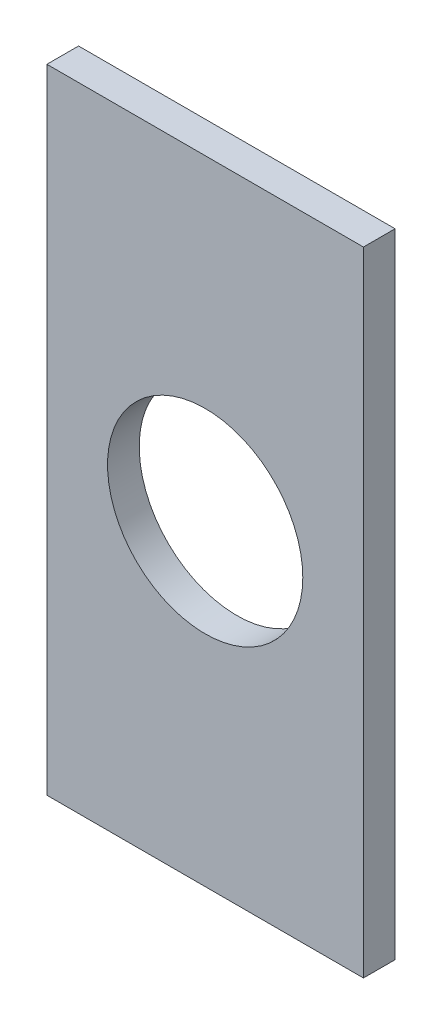
ISO-10303-21;
HEADER;
FILE_DESCRIPTION(('STEP AP214'),'2;1');
FILE_NAME('part.step','',(''),(''),'','','');
FILE_SCHEMA(('AUTOMOTIVE_DESIGN { 1 0 10303 214 1 1 1 1 }'));
ENDSEC;
DATA;
#1=APPLICATION_CONTEXT('core data for automotive mechanical design processes');
#2=APPLICATION_PROTOCOL_DEFINITION('international standard','automotive_design',2000,#1);
#3=PRODUCT_CONTEXT('',#1,'mechanical');
#4=PRODUCT('Part','Part','',(#3));
#5=PRODUCT_RELATED_PRODUCT_CATEGORY('part','',(#4));
#6=PRODUCT_DEFINITION_FORMATION('','',#4);
#7=PRODUCT_DEFINITION_CONTEXT('part definition',#1,'design');
#8=PRODUCT_DEFINITION('design','',#6,#7);
#9=PRODUCT_DEFINITION_SHAPE('','',#8);
#10=(LENGTH_UNIT() NAMED_UNIT(*) SI_UNIT(.MILLI.,.METRE.));
#11=(NAMED_UNIT(*) PLANE_ANGLE_UNIT() SI_UNIT($,.RADIAN.));
#12=(NAMED_UNIT(*) SI_UNIT($,.STERADIAN.) SOLID_ANGLE_UNIT());
#13=UNCERTAINTY_MEASURE_WITH_UNIT(LENGTH_MEASURE(1.E-05),#10,'distance_accuracy_value','');
#14=(GEOMETRIC_REPRESENTATION_CONTEXT(3) GLOBAL_UNCERTAINTY_ASSIGNED_CONTEXT((#13)) GLOBAL_UNIT_ASSIGNED_CONTEXT((#10,
#11,#12)) REPRESENTATION_CONTEXT('',''));
#15=CARTESIAN_POINT('',(0.,0.,0.));
#16=DIRECTION('',(0.,0.,1.));
#17=DIRECTION('',(1.,0.,0.));
#18=AXIS2_PLACEMENT_3D('',#15,#16,#17);
#19=CARTESIAN_POINT('',(25.,50.,5.));
#20=DIRECTION('',(-1.,0.,0.));
#21=DIRECTION('',(0.,-1.,0.));
#22=AXIS2_PLACEMENT_3D('',#19,#20,#21);
#23=PLANE('',#22);
#24=DIRECTION('',(0.,1.,0.));
#25=VECTOR('',#24,1.);
#26=CARTESIAN_POINT('',(25.,50.,0.));
#27=LINE('',#26,#25);
#28=CARTESIAN_POINT('',(25.,-50.,0.));
#29=VERTEX_POINT('',#28);
#30=CARTESIAN_POINT('',(25.,50.,0.));
#31=VERTEX_POINT('',#30);
#32=EDGE_CURVE('E99',#29,#31,#27,.T.);
#33=ORIENTED_EDGE('',*,*,#32,.T.);
#34=DIRECTION('',(0.,0.,-1.));
#35=VECTOR('',#34,1.);
#36=CARTESIAN_POINT('',(25.,50.,5.));
#37=LINE('',#36,#35);
#38=CARTESIAN_POINT('',(25.,50.,5.));
#39=VERTEX_POINT('',#38);
#40=EDGE_CURVE('E11',#39,#31,#37,.T.);
#41=ORIENTED_EDGE('',*,*,#40,.F.);
#42=DIRECTION('',(0.,1.,0.));
#43=VECTOR('',#42,1.);
#44=CARTESIAN_POINT('',(25.,50.,5.));
#45=LINE('',#44,#43);
#46=CARTESIAN_POINT('',(25.,-50.,5.));
#47=VERTEX_POINT('',#46);
#48=EDGE_CURVE('E87',#47,#39,#45,.T.);
#49=ORIENTED_EDGE('',*,*,#48,.F.);
#50=DIRECTION('',(0.,0.,-1.));
#51=VECTOR('',#50,1.);
#52=CARTESIAN_POINT('',(25.,-50.,5.));
#53=LINE('',#52,#51);
#54=EDGE_CURVE('E95',#47,#29,#53,.T.);
#55=ORIENTED_EDGE('',*,*,#54,.T.);
#56=EDGE_LOOP('',(#33,#41,#49,#55));
#57=FACE_BOUND('',#56,.T.);
#58=ADVANCED_FACE('F36',(#57),#23,.F.);
#59=CARTESIAN_POINT('',(-25.,50.,5.));
#60=DIRECTION('',(0.,-1.,0.));
#61=DIRECTION('',(0.,0.,-1.));
#62=AXIS2_PLACEMENT_3D('',#59,#60,#61);
#63=PLANE('',#62);
#64=DIRECTION('',(-1.,0.,0.));
#65=VECTOR('',#64,1.);
#66=CARTESIAN_POINT('',(-25.,50.,0.));
#67=LINE('',#66,#65);
#68=CARTESIAN_POINT('',(-25.,50.,0.));
#69=VERTEX_POINT('',#68);
#70=EDGE_CURVE('E91',#31,#69,#67,.T.);
#71=ORIENTED_EDGE('',*,*,#70,.T.);
#72=DIRECTION('',(0.,0.,-1.));
#73=VECTOR('',#72,1.);
#74=CARTESIAN_POINT('',(-25.,50.,5.));
#75=LINE('',#74,#73);
#76=CARTESIAN_POINT('',(-25.,50.,5.));
#77=VERTEX_POINT('',#76);
#78=EDGE_CURVE('E44',#77,#69,#75,.T.);
#79=ORIENTED_EDGE('',*,*,#78,.F.);
#80=DIRECTION('',(-1.,0.,0.));
#81=VECTOR('',#80,1.);
#82=CARTESIAN_POINT('',(-25.,50.,5.));
#83=LINE('',#82,#81);
#84=EDGE_CURVE('E82',#39,#77,#83,.T.);
#85=ORIENTED_EDGE('',*,*,#84,.F.);
#86=ORIENTED_EDGE('',*,*,#40,.T.);
#87=EDGE_LOOP('',(#71,#79,#85,#86));
#88=FACE_BOUND('',#87,.T.);
#89=ADVANCED_FACE('F90',(#88),#63,.F.);
#90=CARTESIAN_POINT('',(-25.,50.,5.));
#91=DIRECTION('',(1.,0.,0.));
#92=DIRECTION('',(0.,1.,0.));
#93=AXIS2_PLACEMENT_3D('',#90,#91,#92);
#94=PLANE('',#93);
#95=DIRECTION('',(0.,-1.,0.));
#96=VECTOR('',#95,1.);
#97=CARTESIAN_POINT('',(-25.,50.,0.));
#98=LINE('',#97,#96);
#99=CARTESIAN_POINT('',(-25.,-50.,0.));
#100=VERTEX_POINT('',#99);
#101=EDGE_CURVE('E69',#69,#100,#98,.T.);
#102=ORIENTED_EDGE('',*,*,#101,.T.);
#103=DIRECTION('',(0.,0.,-1.));
#104=VECTOR('',#103,1.);
#105=CARTESIAN_POINT('',(-25.,-50.,5.));
#106=LINE('',#105,#104);
#107=CARTESIAN_POINT('',(-25.,-50.,5.));
#108=VERTEX_POINT('',#107);
#109=EDGE_CURVE('E92',#108,#100,#106,.T.);
#110=ORIENTED_EDGE('',*,*,#109,.F.);
#111=DIRECTION('',(0.,-1.,0.));
#112=VECTOR('',#111,1.);
#113=CARTESIAN_POINT('',(-25.,50.,5.));
#114=LINE('',#113,#112);
#115=EDGE_CURVE('E85',#77,#108,#114,.T.);
#116=ORIENTED_EDGE('',*,*,#115,.F.);
#117=ORIENTED_EDGE('',*,*,#78,.T.);
#118=EDGE_LOOP('',(#102,#110,#116,#117));
#119=FACE_BOUND('',#118,.T.);
#120=ADVANCED_FACE('F93',(#119),#94,.F.);
#121=CARTESIAN_POINT('',(-25.,-50.,5.));
#122=DIRECTION('',(0.,1.,0.));
#123=DIRECTION('',(0.,0.,1.));
#124=AXIS2_PLACEMENT_3D('',#121,#122,#123);
#125=PLANE('',#124);
#126=DIRECTION('',(1.,0.,0.));
#127=VECTOR('',#126,1.);
#128=CARTESIAN_POINT('',(-25.,-50.,0.));
#129=LINE('',#128,#127);
#130=EDGE_CURVE('E75',#100,#29,#129,.T.);
#131=ORIENTED_EDGE('',*,*,#130,.T.);
#132=ORIENTED_EDGE('',*,*,#54,.F.);
#133=DIRECTION('',(1.,0.,0.));
#134=VECTOR('',#133,1.);
#135=CARTESIAN_POINT('',(-25.,-50.,5.));
#136=LINE('',#135,#134);
#137=EDGE_CURVE('E52',#108,#47,#136,.T.);
#138=ORIENTED_EDGE('',*,*,#137,.F.);
#139=ORIENTED_EDGE('',*,*,#109,.T.);
#140=EDGE_LOOP('',(#131,#132,#138,#139));
#141=FACE_BOUND('',#140,.T.);
#142=ADVANCED_FACE('F107',(#141),#125,.F.);
#143=CARTESIAN_POINT('',(0.,0.,5.));
#144=DIRECTION('',(0.,0.,1.));
#145=DIRECTION('',(1.,0.,0.));
#146=AXIS2_PLACEMENT_3D('',#143,#144,#145);
#147=PLANE('',#146);
#148=CARTESIAN_POINT('',(0.,0.,5.));
#149=DIRECTION('',(0.,0.,1.));
#150=DIRECTION('',(1.,0.,0.));
#151=AXIS2_PLACEMENT_3D('',#148,#149,#150);
#152=CIRCLE('',#151,15.421138396681);
#153=CARTESIAN_POINT('',(15.421138396681,0.,5.));
#154=VERTEX_POINT('',#153);
#155=EDGE_CURVE('E113',#154,#154,#152,.T.);
#156=ORIENTED_EDGE('',*,*,#155,.F.);
#157=EDGE_LOOP('',(#156));
#158=FACE_BOUND('',#157,.T.);
#159=ORIENTED_EDGE('',*,*,#48,.T.);
#160=ORIENTED_EDGE('',*,*,#84,.T.);
#161=ORIENTED_EDGE('',*,*,#115,.T.);
#162=ORIENTED_EDGE('',*,*,#137,.T.);
#163=EDGE_LOOP('',(#159,#160,#161,#162));
#164=FACE_BOUND('',#163,.T.);
#165=ADVANCED_FACE('F83',(#158,#164),#147,.T.);
#166=CARTESIAN_POINT('',(0.,0.,0.));
#167=DIRECTION('',(0.,0.,1.));
#168=DIRECTION('',(1.,0.,0.));
#169=AXIS2_PLACEMENT_3D('',#166,#167,#168);
#170=PLANE('',#169);
#171=CARTESIAN_POINT('',(0.,0.,0.));
#172=DIRECTION('',(0.,0.,1.));
#173=DIRECTION('',(1.,0.,0.));
#174=AXIS2_PLACEMENT_3D('',#171,#172,#173);
#175=CIRCLE('',#174,15.421138396681);
#176=CARTESIAN_POINT('',(15.421138396681,0.,0.));
#177=VERTEX_POINT('',#176);
#178=EDGE_CURVE('E102',#177,#177,#175,.T.);
#179=ORIENTED_EDGE('',*,*,#178,.T.);
#180=EDGE_LOOP('',(#179));
#181=FACE_BOUND('',#180,.T.);
#182=ORIENTED_EDGE('',*,*,#32,.F.);
#183=ORIENTED_EDGE('',*,*,#130,.F.);
#184=ORIENTED_EDGE('',*,*,#101,.F.);
#185=ORIENTED_EDGE('',*,*,#70,.F.);
#186=EDGE_LOOP('',(#182,#183,#184,#185));
#187=FACE_BOUND('',#186,.T.);
#188=ADVANCED_FACE('F110',(#181,#187),#170,.F.);
#189=CARTESIAN_POINT('',(0.,0.,0.));
#190=DIRECTION('',(0.,0.,1.));
#191=DIRECTION('',(1.,0.,0.));
#192=AXIS2_PLACEMENT_3D('',#189,#190,#191);
#193=CYLINDRICAL_SURFACE('',#192,15.421138396681);
#194=ORIENTED_EDGE('',*,*,#178,.F.);
#195=EDGE_LOOP('',(#194));
#196=FACE_BOUND('',#195,.T.);
#197=ORIENTED_EDGE('',*,*,#155,.T.);
#198=EDGE_LOOP('',(#197));
#199=FACE_BOUND('',#198,.T.);
#200=ADVANCED_FACE('F120',(#196,#199),#193,.F.);
#201=CLOSED_SHELL('',(#58,#89,#120,#142,#165,#188,#200));
#202=MANIFOLD_SOLID_BREP('B2',#201);
#203=ADVANCED_BREP_SHAPE_REPRESENTATION('',(#18,#202),#14);
#204=SHAPE_DEFINITION_REPRESENTATION(#9,#203);
ENDSEC;
END-ISO-10303-21;
